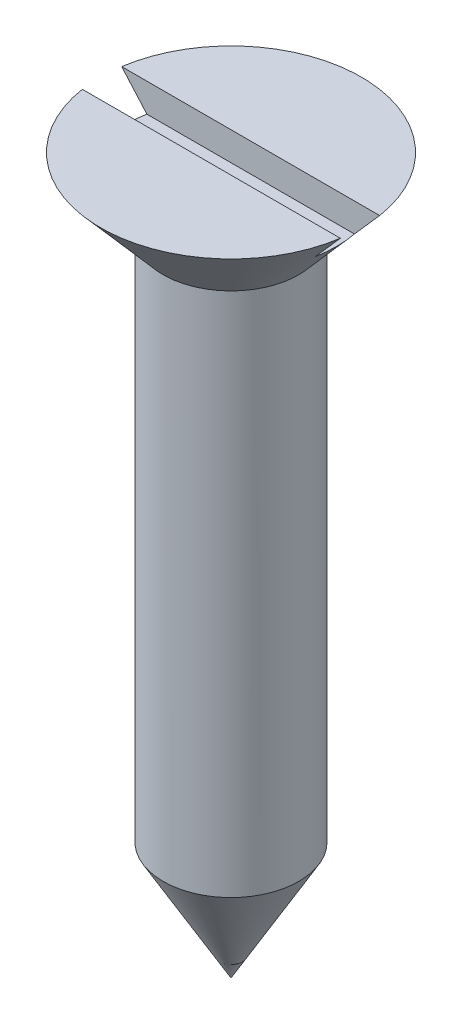
ISO-10303-21;
HEADER;
FILE_DESCRIPTION(('STEP AP214'),'2;1');
FILE_NAME('part.step','',(''),(''),'','','');
FILE_SCHEMA(('AUTOMOTIVE_DESIGN { 1 0 10303 214 1 1 1 1 }'));
ENDSEC;
DATA;
#1=APPLICATION_CONTEXT('core data for automotive mechanical design processes');
#2=APPLICATION_PROTOCOL_DEFINITION('international standard','automotive_design',2000,#1);
#3=PRODUCT_CONTEXT('',#1,'mechanical');
#4=PRODUCT('Part','Part','',(#3));
#5=PRODUCT_RELATED_PRODUCT_CATEGORY('part','',(#4));
#6=PRODUCT_DEFINITION_FORMATION('','',#4);
#7=PRODUCT_DEFINITION_CONTEXT('part definition',#1,'design');
#8=PRODUCT_DEFINITION('design','',#6,#7);
#9=PRODUCT_DEFINITION_SHAPE('','',#8);
#10=(LENGTH_UNIT() NAMED_UNIT(*) SI_UNIT(.MILLI.,.METRE.));
#11=(NAMED_UNIT(*) PLANE_ANGLE_UNIT() SI_UNIT($,.RADIAN.));
#12=(NAMED_UNIT(*) SI_UNIT($,.STERADIAN.) SOLID_ANGLE_UNIT());
#13=UNCERTAINTY_MEASURE_WITH_UNIT(LENGTH_MEASURE(1.E-05),#10,'distance_accuracy_value','');
#14=(GEOMETRIC_REPRESENTATION_CONTEXT(3) GLOBAL_UNCERTAINTY_ASSIGNED_CONTEXT((#13)) GLOBAL_UNIT_ASSIGNED_CONTEXT((#10,
#11,#12)) REPRESENTATION_CONTEXT('',''));
#15=CARTESIAN_POINT('',(0.,0.,0.));
#16=DIRECTION('',(0.,0.,1.));
#17=DIRECTION('',(1.,0.,0.));
#18=AXIS2_PLACEMENT_3D('',#15,#16,#17);
#19=CARTESIAN_POINT('',(0.,20.0674672483271,0.));
#20=DIRECTION('',(0.,1.,0.));
#21=DIRECTION('',(-1.,0.,0.));
#22=AXIS2_PLACEMENT_3D('',#19,#20,#21);
#23=CONICAL_SURFACE('',#22,0.,0.71558499331768);
#24=CARTESIAN_POINT('',(0.,22.8433062149513,0.));
#25=DIRECTION('',(0.,1.,0.));
#26=DIRECTION('',(-1.,0.,0.));
#27=AXIS2_PLACEMENT_3D('',#24,#25,#26);
#28=CIRCLE('',#27,2.413);
#29=CARTESIAN_POINT('',(-2.413,22.8433062149513,0.));
#30=VERTEX_POINT('',#29);
#31=EDGE_CURVE('E80',#30,#30,#28,.F.);
#32=ORIENTED_EDGE('',*,*,#31,.F.);
#33=EDGE_LOOP('',(#32));
#34=FACE_BOUND('',#33,.T.);
#35=CARTESIAN_POINT('',(0.,25.4,0.));
#36=DIRECTION('',(0.,-1.,0.));
#37=DIRECTION('',(1.,0.,0.));
#38=AXIS2_PLACEMENT_3D('',#35,#36,#37);
#39=CIRCLE('',#38,4.6355);
#40=CARTESIAN_POINT('',(4.58257111237785,25.4,0.698499999999999));
#41=VERTEX_POINT('',#40);
#42=CARTESIAN_POINT('',(-4.58257111237785,25.4,0.6985));
#43=VERTEX_POINT('',#42);
#44=EDGE_CURVE('E90',#41,#43,#39,.T.);
#45=ORIENTED_EDGE('',*,*,#44,.T.);
#46=CARTESIAN_POINT('',(-12.7239228215764,34.7267050796105,0.698500000000001));
#47=CARTESIAN_POINT('',(-12.3001572509422,34.2399567929915,0.698500000000001));
#48=CARTESIAN_POINT('',(-11.8763604578224,33.7532356733004,0.698500000000001));
#49=CARTESIAN_POINT('',(-11.0286648911621,32.7798790859785,0.698500000000001));
#50=CARTESIAN_POINT('',(-10.6047661172505,32.2932436186712,0.698500000000001));
#51=CARTESIAN_POINT('',(-9.75675302797371,31.3200047015358,0.698500000000001));
#52=CARTESIAN_POINT('',(-9.33263868742172,30.8334012736527,0.698500000000001));
#53=CARTESIAN_POINT('',(-8.48420562839718,29.8603756240637,0.698500000000001));
#54=CARTESIAN_POINT('',(-8.05988691065428,29.3739534017216,0.698500000000001));
#55=CARTESIAN_POINT('',(-7.21643989721948,28.4077138051512,0.698500000000001));
#56=CARTESIAN_POINT('',(-6.79731581568079,27.9278927523369,0.698500000000001));
#57=CARTESIAN_POINT('',(-5.9585342629898,26.9687079309938,0.698500000000001));
#58=CARTESIAN_POINT('',(-5.53887678636064,26.4893441672505,0.6985));
#59=CARTESIAN_POINT('',(-4.90864472636626,25.7710111396984,0.6985));
#60=CARTESIAN_POINT('',(-4.69845756911361,25.5317020261792,0.6985));
#61=CARTESIAN_POINT('',(-4.27769572212294,25.0534248115906,0.6985));
#62=CARTESIAN_POINT('',(-4.06712103270088,24.8144567102434,0.6985));
#63=CARTESIAN_POINT('',(-3.64537119919808,24.337058128522,0.6985));
#64=CARTESIAN_POINT('',(-3.43419606529337,24.098627639158,0.6985));
#65=CARTESIAN_POINT('',(-3.01084873187951,23.6226538951711,0.6985));
#66=CARTESIAN_POINT('',(-2.7986765400007,23.3851106337833,0.6985));
#67=CARTESIAN_POINT('',(-2.52960029103577,23.0862972349534,0.6985));
#68=CARTESIAN_POINT('',(-2.47358661504904,23.0242256625783,0.6985));
#69=CARTESIAN_POINT('',(-2.36139296082812,22.9002327427108,0.6985));
#70=CARTESIAN_POINT('',(-2.30521298227076,22.8383113955107,0.6985));
#71=CARTESIAN_POINT('',(-2.13635225908663,22.6527988956865,0.6985));
#72=CARTESIAN_POINT('',(-2.02337060257295,22.5294814069046,0.6985));
#73=CARTESIAN_POINT('',(-1.79574198127606,22.2835404232174,0.6985));
#74=CARTESIAN_POINT('',(-1.6810904114627,22.1609211651909,0.6985));
#75=CARTESIAN_POINT('',(-1.50750068681164,21.9785742781316,0.6985));
#76=CARTESIAN_POINT('',(-1.44938125202165,21.9180683523885,0.6985));
#77=CARTESIAN_POINT('',(-1.33238722051911,21.7977922352814,0.6985));
#78=CARTESIAN_POINT('',(-1.27351264915802,21.7380220193496,0.6985));
#79=CARTESIAN_POINT('',(-1.1548804695129,21.6197311388379,0.6985));
#80=CARTESIAN_POINT('',(-1.09512614368295,21.5612071896788,0.6985));
#81=CARTESIAN_POINT('',(-0.973994870008152,21.4457046252388,0.6985));
#82=CARTESIAN_POINT('',(-0.912616182481279,21.3887278111058,0.6985));
#83=CARTESIAN_POINT('',(-0.81877353349085,21.3053328562651,0.6985));
#84=CARTESIAN_POINT('',(-0.787217167328208,21.2778960935856,0.6985));
#85=CARTESIAN_POINT('',(-0.723332736964154,21.2239392262751,0.6985));
#86=CARTESIAN_POINT('',(-0.691004772567417,21.1974190041662,0.6985));
#87=CARTESIAN_POINT('',(-0.625412332691123,21.1456724443173,0.6985));
#88=CARTESIAN_POINT('',(-0.592149556102299,21.1204439682205,0.6985));
#89=CARTESIAN_POINT('',(-0.524362542232245,21.0717559037805,0.6985));
#90=CARTESIAN_POINT('',(-0.48983895342333,21.0482954246096,0.6985));
#91=CARTESIAN_POINT('',(-0.429936342470146,21.0107179276523,0.6985));
#92=CARTESIAN_POINT('',(-0.40498158505333,20.9959343161634,0.6985));
#93=CARTESIAN_POINT('',(-0.354168078423243,20.9680198218979,0.6985));
#94=CARTESIAN_POINT('',(-0.328309003136593,20.954889543287,0.6985));
#95=CARTESIAN_POINT('',(-0.249541962976163,20.9189531994753,0.6985));
#96=CARTESIAN_POINT('',(-0.195013627804838,20.8993108243764,0.6985));
#97=CARTESIAN_POINT('',(-0.102859532567764,20.8786540032705,0.6985));
#98=CARTESIAN_POINT('',(-0.0661918503363941,20.8734839778991,0.6985));
#99=CARTESIAN_POINT('',(0.00749446603889363,20.869933118363,0.6985));
#100=CARTESIAN_POINT('',(0.0445130627158196,20.8715515673633,0.6985));
#101=CARTESIAN_POINT('',(0.11744311765093,20.8812111194697,0.6985));
#102=CARTESIAN_POINT('',(0.153359548949535,20.8892168159623,0.6985));
#103=CARTESIAN_POINT('',(0.223673805090347,20.9102825299732,0.6985));
#104=CARTESIAN_POINT('',(0.25806897988161,20.9233510082476,0.6985));
#105=CARTESIAN_POINT('',(0.337845909296767,20.9586983729871,0.6985));
#106=CARTESIAN_POINT('',(0.382493346961351,20.9825926947749,0.6985));
#107=CARTESIAN_POINT('',(0.469309381305251,21.0345838888427,0.6985));
#108=CARTESIAN_POINT('',(0.511471761563966,21.0626907248402,0.6985));
#109=CARTESIAN_POINT('',(0.594249640056042,21.1217821729536,0.6985));
#110=CARTESIAN_POINT('',(0.634848796846487,21.1527893706914,0.6985));
#111=CARTESIAN_POINT('',(0.714582801882175,21.2165191107184,0.6985));
#112=CARTESIAN_POINT('',(0.753719291243202,21.2492396252045,0.6985));
#113=CARTESIAN_POINT('',(0.83552577320042,21.3198319117916,0.6985));
#114=CARTESIAN_POINT('',(0.878064805214551,21.3578545855142,0.6985));
#115=CARTESIAN_POINT('',(0.962191267313018,21.434941679311,0.6985));
#116=CARTESIAN_POINT('',(1.00377858362062,21.4740062227434,0.6985));
#117=CARTESIAN_POINT('',(1.12751779421428,21.592333115131,0.6985));
#118=CARTESIAN_POINT('',(1.20861242142424,21.6726979874992,0.6985));
#119=CARTESIAN_POINT('',(1.36926043924456,21.8351978109182,0.6985));
#120=CARTESIAN_POINT('',(1.44881105894343,21.9173354697024,0.6985));
#121=CARTESIAN_POINT('',(1.60680399965922,22.0826301430578,0.6985));
#122=CARTESIAN_POINT('',(1.68524658609653,22.1657869042817,0.6985));
#123=CARTESIAN_POINT('',(1.84105486552689,22.3324285213077,0.6985));
#124=CARTESIAN_POINT('',(1.91842374830412,22.4159104038166,0.6985));
#125=CARTESIAN_POINT('',(2.07264424422746,22.5833596873232,0.6985));
#126=CARTESIAN_POINT('',(2.14949582502339,22.6673271180858,0.698499999999999));
#127=CARTESIAN_POINT('',(2.30274294913764,22.8355324531098,0.698499999999999));
#128=CARTESIAN_POINT('',(2.37913885304034,22.9197700291865,0.698499999999999));
#129=CARTESIAN_POINT('',(2.53163793098701,23.0885063911911,0.698499999999999));
#130=CARTESIAN_POINT('',(2.60774111109123,23.1730051716453,0.698499999999999));
#131=CARTESIAN_POINT('',(2.83524944043017,23.4262812671101,0.698499999999999));
#132=CARTESIAN_POINT('',(2.98632334759572,23.59535603595,0.698499999999999));
#133=CARTESIAN_POINT('',(3.28790976185477,23.9340057477976,0.698499999999999));
#134=CARTESIAN_POINT('',(3.43842226715196,24.1035806924027,0.698499999999999));
#135=CARTESIAN_POINT('',(3.88940429195368,24.6128067119154,0.698499999999999));
#136=CARTESIAN_POINT('',(4.18931362033165,24.9529537122863,0.698499999999999));
#137=CARTESIAN_POINT('',(4.7884830035293,25.6340410832954,0.698499999999999));
#138=CARTESIAN_POINT('',(5.08774277725767,25.9749817007917,0.698499999999999));
#139=CARTESIAN_POINT('',(5.68580423403497,26.6572601749776,0.698499999999999));
#140=CARTESIAN_POINT('',(5.98460592033786,26.998598028815,0.698499999999999));
#141=CARTESIAN_POINT('',(6.58212446863918,27.6817577229068,0.698499999999999));
#142=CARTESIAN_POINT('',(6.88084113472905,28.02357973444,0.698499999999999));
#143=CARTESIAN_POINT('',(7.4780790309394,28.7073955715389,0.698499999999999));
#144=CARTESIAN_POINT('',(7.77660026069077,29.0493893974269,0.698499999999999));
#145=CARTESIAN_POINT('',(8.67190206860342,30.0754810716293,0.698499999999999));
#146=CARTESIAN_POINT('',(9.26847941809736,30.7597562299953,0.698499999999999));
#147=CARTESIAN_POINT('',(10.1032855644842,31.7176960435836,0.698499999999999));
#148=CARTESIAN_POINT('',(10.3416380636654,31.9912529385897,0.698499999999998));
#149=CARTESIAN_POINT('',(10.8183081974686,32.5384075301571,0.698499999999998));
#150=CARTESIAN_POINT('',(11.0566258312235,32.8120052274739,0.698499999999998));
#151=CARTESIAN_POINT('',(11.5331247452633,33.3591094482983,0.698499999999998));
#152=CARTESIAN_POINT('',(11.771306039674,33.6326159595041,0.698499999999998));
#153=CARTESIAN_POINT('',(12.247636192647,34.1796467893632,0.698499999999998));
#154=CARTESIAN_POINT('',(12.4857850518011,34.4531711075014,0.698499999999998));
#155=CARTESIAN_POINT('',(12.7239228215764,34.7267050796105,0.698499999999998));
#156=B_SPLINE_CURVE_WITH_KNOTS('',3,(#46,#47,#48,#49,#50,#51,#52,#53,#54,#55,#56,#57,#58,#59,
#60,#61,#62,#63,#64,#65,#66,#67,#68,#69,#70,#71,#72,#73,#74,#75,#76,#77,#78,#79,#80,#81,#82,#83,
#84,#85,#86,#87,#88,#89,#90,#91,#92,#93,#94,#95,#96,#97,#98,#99,#100,#101,#102,#103,#104,#105,
#106,#107,#108,#109,#110,#111,#112,#113,#114,#115,#116,#117,#118,#119,#120,#121,#122,#123,#124,
#125,#126,#127,#128,#129,#130,#131,#132,#133,#134,#135,#136,#137,#138,#139,#140,#141,#142,#143,
#144,#145,#146,#147,#148,#149,#150,#151,#152,#153,#154,#155),.UNSPECIFIED.,.F.,.F.,(4,2,2,2,2,2,
2,2,2,2,2,2,2,2,2,2,2,2,2,2,2,2,2,2,2,2,2,2,2,2,2,2,2,2,2,2,2,2,2,2,2,2,2,2,2,2,2,2,2,2,2,2,2,2,
4),(0.,1.93610703396338,3.87222122797829,5.80868778183581,7.7451474728189,9.65643989316126,
11.5677520996607,12.5232765769618,13.47880027555,14.4343078757767,15.3898081755048,
15.640633977122,15.8914602664639,16.3932020613795,16.8967943256568,17.1484833970821,
17.4001640407986,17.6510686611943,17.9022538399665,18.0276896509004,18.153109323964,
18.2783141788676,18.4034555199564,18.490409847424,18.5773958583439,18.7498208611675,
18.860357411385,18.97088228969,19.0807987138587,19.190899624726,19.3424178487974,
19.4943002810343,19.6474835460643,19.8004894373384,19.9716296266773,20.1427901699017,
20.4852498455254,20.8282759218775,21.1712183859412,21.5126780217801,21.8541588164888,
22.1953188217535,22.5364717255511,23.2166799578199,23.8968903646734,25.257332340472,
26.6182773713813,27.9792126897512,29.3410736162872,30.7029371076116,33.4263966969397,
34.5148853756531,35.603397635475,36.6914349798753,37.7794487121095),.UNSPECIFIED.);
#157=CARTESIAN_POINT('',(-3.68671779763034,24.384,0.6985));
#158=VERTEX_POINT('',#157);
#159=EDGE_CURVE('E94',#43,#158,#156,.T.);
#160=ORIENTED_EDGE('',*,*,#159,.T.);
#161=CARTESIAN_POINT('',(0.,24.384,0.));
#162=DIRECTION('',(0.,-1.,0.));
#163=DIRECTION('',(0.,0.,-1.));
#164=AXIS2_PLACEMENT_3D('',#161,#162,#163);
#165=CIRCLE('',#164,3.7523046743787);
#166=CARTESIAN_POINT('',(-3.68671779763034,24.384,-0.6985));
#167=VERTEX_POINT('',#166);
#168=EDGE_CURVE('E11',#167,#158,#165,.F.);
#169=ORIENTED_EDGE('',*,*,#168,.F.);
#170=CARTESIAN_POINT('',(-12.7239228215764,34.7267050796105,-0.698499999999999));
#171=CARTESIAN_POINT('',(-12.3001572509422,34.2399567929915,-0.698499999999999));
#172=CARTESIAN_POINT('',(-11.8763604578224,33.7532356733004,-0.698499999999999));
#173=CARTESIAN_POINT('',(-11.0286648911621,32.7798790859785,-0.698499999999999));
#174=CARTESIAN_POINT('',(-10.6047661172505,32.2932436186712,-0.698499999999999));
#175=CARTESIAN_POINT('',(-9.7567530279737,31.3200047015358,-0.698499999999999));
#176=CARTESIAN_POINT('',(-9.33263868742171,30.8334012736527,-0.698499999999999));
#177=CARTESIAN_POINT('',(-8.48420562839717,29.8603756240637,-0.698499999999999));
#178=CARTESIAN_POINT('',(-8.05988691065427,29.3739534017216,-0.698499999999999));
#179=CARTESIAN_POINT('',(-7.21643989721948,28.4077138051512,-0.698499999999999));
#180=CARTESIAN_POINT('',(-6.79731581568079,27.9278927523369,-0.698499999999999));
#181=CARTESIAN_POINT('',(-5.95853426298979,26.9687079309938,-0.698499999999999));
#182=CARTESIAN_POINT('',(-5.53887678636063,26.4893441672505,-0.6985));
#183=CARTESIAN_POINT('',(-4.90864472636625,25.7710111396984,-0.6985));
#184=CARTESIAN_POINT('',(-4.6984575691136,25.5317020261792,-0.6985));
#185=CARTESIAN_POINT('',(-4.27769572212293,25.0534248115906,-0.6985));
#186=CARTESIAN_POINT('',(-4.06712103270087,24.8144567102434,-0.6985));
#187=CARTESIAN_POINT('',(-3.64537119919807,24.337058128522,-0.6985));
#188=CARTESIAN_POINT('',(-3.43419606529337,24.098627639158,-0.6985));
#189=CARTESIAN_POINT('',(-3.01084873187951,23.6226538951711,-0.6985));
#190=CARTESIAN_POINT('',(-2.7986765400007,23.3851106337833,-0.6985));
#191=CARTESIAN_POINT('',(-2.52960029103577,23.0862972349534,-0.6985));
#192=CARTESIAN_POINT('',(-2.47358661504904,23.0242256625783,-0.6985));
#193=CARTESIAN_POINT('',(-2.36139296082812,22.9002327427108,-0.6985));
#194=CARTESIAN_POINT('',(-2.30521298227076,22.8383113955107,-0.6985));
#195=CARTESIAN_POINT('',(-2.13635225908663,22.6527988956865,-0.6985));
#196=CARTESIAN_POINT('',(-2.02337060257295,22.5294814069046,-0.6985));
#197=CARTESIAN_POINT('',(-1.79574198127606,22.2835404232174,-0.6985));
#198=CARTESIAN_POINT('',(-1.68109041146269,22.1609211651909,-0.6985));
#199=CARTESIAN_POINT('',(-1.50750068681163,21.9785742781316,-0.6985));
#200=CARTESIAN_POINT('',(-1.44938125202165,21.9180683523885,-0.6985));
#201=CARTESIAN_POINT('',(-1.33238722051911,21.7977922352814,-0.6985));
#202=CARTESIAN_POINT('',(-1.27351264915802,21.7380220193496,-0.6985));
#203=CARTESIAN_POINT('',(-1.1548804695129,21.6197311388379,-0.6985));
#204=CARTESIAN_POINT('',(-1.09512614368294,21.5612071896788,-0.6985));
#205=CARTESIAN_POINT('',(-0.973994870008151,21.4457046252388,-0.6985));
#206=CARTESIAN_POINT('',(-0.91261618248128,21.3887278111057,-0.6985));
#207=CARTESIAN_POINT('',(-0.818773533490852,21.3053328562651,-0.6985));
#208=CARTESIAN_POINT('',(-0.787217167328209,21.2778960935856,-0.6985));
#209=CARTESIAN_POINT('',(-0.723332736964154,21.2239392262751,-0.6985));
#210=CARTESIAN_POINT('',(-0.691004772567416,21.1974190041662,-0.6985));
#211=CARTESIAN_POINT('',(-0.625412332691123,21.1456724443173,-0.6985));
#212=CARTESIAN_POINT('',(-0.5921495561023,21.1204439682205,-0.6985));
#213=CARTESIAN_POINT('',(-0.524362542232246,21.0717559037805,-0.6985));
#214=CARTESIAN_POINT('',(-0.489838953423329,21.0482954246096,-0.6985));
#215=CARTESIAN_POINT('',(-0.429936342470145,21.0107179276523,-0.6985));
#216=CARTESIAN_POINT('',(-0.404981585053328,20.9959343161634,-0.6985));
#217=CARTESIAN_POINT('',(-0.354168078423242,20.9680198218979,-0.6985));
#218=CARTESIAN_POINT('',(-0.328309003136591,20.954889543287,-0.6985));
#219=CARTESIAN_POINT('',(-0.249541962976161,20.9189531994753,-0.6985));
#220=CARTESIAN_POINT('',(-0.195013627804836,20.8993108243764,-0.6985));
#221=CARTESIAN_POINT('',(-0.102859532567763,20.8786540032705,-0.6985));
#222=CARTESIAN_POINT('',(-0.0661918503363925,20.8734839778991,-0.6985));
#223=CARTESIAN_POINT('',(0.00749446603889545,20.869933118363,-0.6985));
#224=CARTESIAN_POINT('',(0.0445130627158216,20.8715515673633,-0.6985));
#225=CARTESIAN_POINT('',(0.117443117650932,20.8812111194697,-0.6985));
#226=CARTESIAN_POINT('',(0.153359548949537,20.8892168159623,-0.6985));
#227=CARTESIAN_POINT('',(0.223673805090348,20.9102825299732,-0.6985));
#228=CARTESIAN_POINT('',(0.258068979881611,20.9233510082476,-0.6985));
#229=CARTESIAN_POINT('',(0.337845909296768,20.9586983729871,-0.6985));
#230=CARTESIAN_POINT('',(0.38249334696135,20.9825926947749,-0.6985));
#231=CARTESIAN_POINT('',(0.46930938130525,21.0345838888427,-0.6985));
#232=CARTESIAN_POINT('',(0.511471761563966,21.0626907248402,-0.6985));
#233=CARTESIAN_POINT('',(0.594249640056044,21.1217821729536,-0.6985));
#234=CARTESIAN_POINT('',(0.634848796846489,21.1527893706914,-0.6985));
#235=CARTESIAN_POINT('',(0.714582801882179,21.2165191107184,-0.6985));
#236=CARTESIAN_POINT('',(0.753719291243206,21.2492396252045,-0.6985));
#237=CARTESIAN_POINT('',(0.835525773200425,21.3198319117916,-0.6985));
#238=CARTESIAN_POINT('',(0.878064805214557,21.3578545855142,-0.6985));
#239=CARTESIAN_POINT('',(0.962191267313024,21.434941679311,-0.6985));
#240=CARTESIAN_POINT('',(1.00377858362063,21.4740062227434,-0.6985));
#241=CARTESIAN_POINT('',(1.12751779421429,21.592333115131,-0.6985));
#242=CARTESIAN_POINT('',(1.20861242142425,21.6726979874992,-0.6985));
#243=CARTESIAN_POINT('',(1.36926043924457,21.8351978109182,-0.6985));
#244=CARTESIAN_POINT('',(1.44881105894343,21.9173354697024,-0.6985));
#245=CARTESIAN_POINT('',(1.60680399965923,22.0826301430578,-0.6985));
#246=CARTESIAN_POINT('',(1.68524658609654,22.1657869042817,-0.6985));
#247=CARTESIAN_POINT('',(1.8410548655269,22.3324285213077,-0.6985));
#248=CARTESIAN_POINT('',(1.91842374830413,22.4159104038166,-0.6985));
#249=CARTESIAN_POINT('',(2.07264424422748,22.5833596873232,-0.6985));
#250=CARTESIAN_POINT('',(2.14949582502341,22.6673271180858,-0.698500000000001));
#251=CARTESIAN_POINT('',(2.30274294913765,22.8355324531098,-0.698500000000001));
#252=CARTESIAN_POINT('',(2.37913885304036,22.9197700291865,-0.698500000000001));
#253=CARTESIAN_POINT('',(2.53163793098703,23.0885063911911,-0.698500000000001));
#254=CARTESIAN_POINT('',(2.60774111109125,23.1730051716453,-0.698500000000001));
#255=CARTESIAN_POINT('',(2.83524944043019,23.4262812671101,-0.698500000000001));
#256=CARTESIAN_POINT('',(2.98632334759574,23.59535603595,-0.698500000000001));
#257=CARTESIAN_POINT('',(3.28790976185479,23.9340057477976,-0.698500000000001));
#258=CARTESIAN_POINT('',(3.43842226715199,24.1035806924027,-0.698500000000001));
#259=CARTESIAN_POINT('',(3.88940429195371,24.6128067119154,-0.698500000000001));
#260=CARTESIAN_POINT('',(4.18931362033168,24.9529537122863,-0.698500000000001));
#261=CARTESIAN_POINT('',(4.78848300352934,25.6340410832955,-0.698500000000001));
#262=CARTESIAN_POINT('',(5.08774277725772,25.9749817007918,-0.698500000000001));
#263=CARTESIAN_POINT('',(5.68580423403502,26.6572601749777,-0.698500000000001));
#264=CARTESIAN_POINT('',(5.98460592033792,26.998598028815,-0.698500000000001));
#265=CARTESIAN_POINT('',(6.58212446863924,27.6817577229069,-0.698500000000001));
#266=CARTESIAN_POINT('',(6.88084113472911,28.0235797344401,-0.698500000000001));
#267=CARTESIAN_POINT('',(7.47807903093947,28.707395571539,-0.698500000000001));
#268=CARTESIAN_POINT('',(7.77660026069085,29.049389397427,-0.698500000000001));
#269=CARTESIAN_POINT('',(8.6719020686035,30.0754810716294,-0.698500000000001));
#270=CARTESIAN_POINT('',(9.26847941809745,30.7597562299954,-0.698500000000001));
#271=CARTESIAN_POINT('',(10.1032855644843,31.7176960435837,-0.698500000000001));
#272=CARTESIAN_POINT('',(10.3416380636655,31.9912529385898,-0.698500000000002));
#273=CARTESIAN_POINT('',(10.8183081974687,32.5384075301572,-0.698500000000002));
#274=CARTESIAN_POINT('',(11.0566258312235,32.8120052274739,-0.698500000000002));
#275=CARTESIAN_POINT('',(11.5331247452634,33.3591094482984,-0.698500000000002));
#276=CARTESIAN_POINT('',(11.771306039674,33.6326159595041,-0.698500000000002));
#277=CARTESIAN_POINT('',(12.247636192647,34.1796467893632,-0.698500000000002));
#278=CARTESIAN_POINT('',(12.4857850518011,34.4531711075014,-0.698500000000002));
#279=CARTESIAN_POINT('',(12.7239228215764,34.7267050796105,-0.698500000000002));
#280=B_SPLINE_CURVE_WITH_KNOTS('',3,(#170,#171,#172,#173,#174,#175,#176,#177,#178,#179,#180,
#181,#182,#183,#184,#185,#186,#187,#188,#189,#190,#191,#192,#193,#194,#195,#196,#197,#198,#199,
#200,#201,#202,#203,#204,#205,#206,#207,#208,#209,#210,#211,#212,#213,#214,#215,#216,#217,#218,
#219,#220,#221,#222,#223,#224,#225,#226,#227,#228,#229,#230,#231,#232,#233,#234,#235,#236,#237,
#238,#239,#240,#241,#242,#243,#244,#245,#246,#247,#248,#249,#250,#251,#252,#253,#254,#255,#256,
#257,#258,#259,#260,#261,#262,#263,#264,#265,#266,#267,#268,#269,#270,#271,#272,#273,#274,#275,
#276,#277,#278,#279),.UNSPECIFIED.,.F.,.F.,(4,2,2,2,2,2,2,2,2,2,2,2,2,2,2,2,2,2,2,2,2,2,2,2,2,2,
2,2,2,2,2,2,2,2,2,2,2,2,2,2,2,2,2,2,2,2,2,2,2,2,2,2,2,2,4),(0.,1.93610703396338,3.8722212279783,
5.80868778183583,7.74514747281891,9.65643989316127,11.5677520996607,12.5232765769618,
13.47880027555,14.4343078757767,15.3898081755048,15.640633977122,15.8914602664639,
16.3932020613795,16.8967943256568,17.1484833970821,17.4001640407986,17.6510686611943,
17.9022538399665,18.0276896509004,18.153109323964,18.2783141788676,18.4034555199564,
18.490409847424,18.5773958583439,18.7498208611675,18.860357411385,18.97088228969,
19.0807987138587,19.190899624726,19.3424178487974,19.4943002810343,19.6474835460643,
19.8004894373384,19.9716296266774,20.1427901699017,20.4852498455254,20.8282759218775,
21.1712183859413,21.5126780217801,21.8541588164888,22.1953188217535,22.5364717255512,
23.2166799578199,23.8968903646734,25.2573323404721,26.6182773713814,27.9792126897513,
29.3410736162873,30.7029371076117,33.4263966969398,34.5148853756532,35.6033976354751,
36.6914349798753,37.7794487121095),.UNSPECIFIED.);
#281=CARTESIAN_POINT('',(-4.58257111237785,25.4,-0.6985));
#282=VERTEX_POINT('',#281);
#283=EDGE_CURVE('E74',#282,#167,#280,.T.);
#284=ORIENTED_EDGE('',*,*,#283,.F.);
#285=CARTESIAN_POINT('',(4.58257111237785,25.4,-0.698500000000001));
#286=VERTEX_POINT('',#285);
#287=EDGE_CURVE('E85',#282,#286,#39,.T.);
#288=ORIENTED_EDGE('',*,*,#287,.T.);
#289=CARTESIAN_POINT('',(3.68671779763034,24.384,-0.6985));
#290=VERTEX_POINT('',#289);
#291=EDGE_CURVE('E48',#290,#286,#280,.T.);
#292=ORIENTED_EDGE('',*,*,#291,.F.);
#293=CARTESIAN_POINT('',(3.68671779763034,24.384,0.698499999999999));
#294=VERTEX_POINT('',#293);
#295=EDGE_CURVE('E37',#294,#290,#165,.F.);
#296=ORIENTED_EDGE('',*,*,#295,.F.);
#297=EDGE_CURVE('E87',#294,#41,#156,.T.);
#298=ORIENTED_EDGE('',*,*,#297,.T.);
#299=EDGE_LOOP('',(#45,#160,#169,#284,#288,#292,#296,#298));
#300=FACE_BOUND('',#299,.T.);
#301=ADVANCED_FACE('F33',(#34,#300),#23,.T.);
#302=CARTESIAN_POINT('',(0.,25.4,0.));
#303=DIRECTION('',(0.,1.,0.));
#304=DIRECTION('',(0.,0.,1.));
#305=AXIS2_PLACEMENT_3D('',#302,#303,#304);
#306=PLANE('',#305);
#307=ORIENTED_EDGE('',*,*,#44,.F.);
#308=DIRECTION('',(-1.,0.,0.));
#309=VECTOR('',#308,1.);
#310=CARTESIAN_POINT('',(0.,25.4,0.6985));
#311=LINE('',#310,#309);
#312=EDGE_CURVE('E79',#41,#43,#311,.T.);
#313=ORIENTED_EDGE('',*,*,#312,.T.);
#314=EDGE_LOOP('',(#307,#313));
#315=FACE_BOUND('',#314,.T.);
#316=ADVANCED_FACE('F138',(#315),#306,.T.);
#317=CARTESIAN_POINT('',(0.,25.4,0.));
#318=DIRECTION('',(0.,-1.,0.));
#319=DIRECTION('',(0.,0.,-1.));
#320=AXIS2_PLACEMENT_3D('',#317,#318,#319);
#321=CYLINDRICAL_SURFACE('',#320,2.413);
#322=CARTESIAN_POINT('',(0.,4.17943859866376,0.));
#323=DIRECTION('',(0.,1.,0.));
#324=DIRECTION('',(0.,0.,1.));
#325=AXIS2_PLACEMENT_3D('',#322,#323,#324);
#326=CIRCLE('',#325,2.413);
#327=CARTESIAN_POINT('',(0.,4.17943859866376,2.413));
#328=VERTEX_POINT('',#327);
#329=EDGE_CURVE('E91',#328,#328,#326,.T.);
#330=ORIENTED_EDGE('',*,*,#329,.T.);
#331=EDGE_LOOP('',(#330));
#332=FACE_BOUND('',#331,.T.);
#333=ORIENTED_EDGE('',*,*,#31,.T.);
#334=EDGE_LOOP('',(#333));
#335=FACE_BOUND('',#334,.T.);
#336=ADVANCED_FACE('F35',(#332,#335),#321,.T.);
#337=DIRECTION('',(-1.,0.,0.));
#338=VECTOR('',#337,1.);
#339=CARTESIAN_POINT('',(0.,25.4,-0.6985));
#340=LINE('',#339,#338);
#341=EDGE_CURVE('E71',#286,#282,#340,.T.);
#342=ORIENTED_EDGE('',*,*,#341,.F.);
#343=ORIENTED_EDGE('',*,*,#287,.F.);
#344=EDGE_LOOP('',(#342,#343));
#345=FACE_BOUND('',#344,.T.);
#346=ADVANCED_FACE('F89',(#345),#306,.T.);
#347=CARTESIAN_POINT('',(0.,0.,0.));
#348=DIRECTION('',(0.,1.,0.));
#349=DIRECTION('',(0.,0.,1.));
#350=AXIS2_PLACEMENT_3D('',#347,#348,#349);
#351=CONICAL_SURFACE('',#350,0.,0.523598775598293);
#352=ORIENTED_EDGE('',*,*,#329,.F.);
#353=EDGE_LOOP('',(#352));
#354=FACE_BOUND('',#353,.T.);
#355=CARTESIAN_POINT('',(0.,0.,0.));
#356=VERTEX_POINT('',#355);
#357=VERTEX_LOOP('',#356);
#358=FACE_BOUND('',#357,.T.);
#359=ADVANCED_FACE('F131',(#354,#358),#351,.T.);
#360=CARTESIAN_POINT('',(7.08727897658466,24.384,0.698499999999999));
#361=DIRECTION('',(0.,0.,-1.));
#362=DIRECTION('',(-1.,0.,0.));
#363=AXIS2_PLACEMENT_3D('',#360,#361,#362);
#364=PLANE('',#363);
#365=ORIENTED_EDGE('',*,*,#312,.F.);
#366=ORIENTED_EDGE('',*,*,#297,.F.);
#367=DIRECTION('',(-1.,0.,0.));
#368=VECTOR('',#367,1.);
#369=CARTESIAN_POINT('',(7.08727897658466,24.384,0.698499999999999));
#370=LINE('',#369,#368);
#371=EDGE_CURVE('E108',#294,#158,#370,.T.);
#372=ORIENTED_EDGE('',*,*,#371,.T.);
#373=ORIENTED_EDGE('',*,*,#159,.F.);
#374=EDGE_LOOP('',(#365,#366,#372,#373));
#375=FACE_BOUND('',#374,.T.);
#376=ADVANCED_FACE('F128',(#375),#364,.T.);
#377=CARTESIAN_POINT('',(7.08727897658466,24.384,-0.698500000000001));
#378=DIRECTION('',(0.,0.,-1.));
#379=DIRECTION('',(-1.,0.,0.));
#380=AXIS2_PLACEMENT_3D('',#377,#378,#379);
#381=PLANE('',#380);
#382=ORIENTED_EDGE('',*,*,#283,.T.);
#383=DIRECTION('',(-1.,0.,0.));
#384=VECTOR('',#383,1.);
#385=CARTESIAN_POINT('',(7.08727897658466,24.384,-0.698500000000001));
#386=LINE('',#385,#384);
#387=EDGE_CURVE('E106',#290,#167,#386,.T.);
#388=ORIENTED_EDGE('',*,*,#387,.F.);
#389=ORIENTED_EDGE('',*,*,#291,.T.);
#390=ORIENTED_EDGE('',*,*,#341,.T.);
#391=EDGE_LOOP('',(#382,#388,#389,#390));
#392=FACE_BOUND('',#391,.T.);
#393=ADVANCED_FACE('F73',(#392),#381,.F.);
#394=CARTESIAN_POINT('',(0.,24.384,0.));
#395=DIRECTION('',(0.,-1.,0.));
#396=DIRECTION('',(0.,0.,-1.));
#397=AXIS2_PLACEMENT_3D('',#394,#395,#396);
#398=PLANE('',#397);
#399=ORIENTED_EDGE('',*,*,#168,.T.);
#400=ORIENTED_EDGE('',*,*,#371,.F.);
#401=ORIENTED_EDGE('',*,*,#295,.T.);
#402=ORIENTED_EDGE('',*,*,#387,.T.);
#403=EDGE_LOOP('',(#399,#400,#401,#402));
#404=FACE_BOUND('',#403,.T.);
#405=ADVANCED_FACE('F105',(#404),#398,.F.);
#406=CLOSED_SHELL('',(#301,#316,#336,#346,#359,#376,#393,#405));
#407=MANIFOLD_SOLID_BREP('B2',#406);
#408=ADVANCED_BREP_SHAPE_REPRESENTATION('',(#18,#407),#14);
#409=SHAPE_DEFINITION_REPRESENTATION(#9,#408);
ENDSEC;
END-ISO-10303-21;
